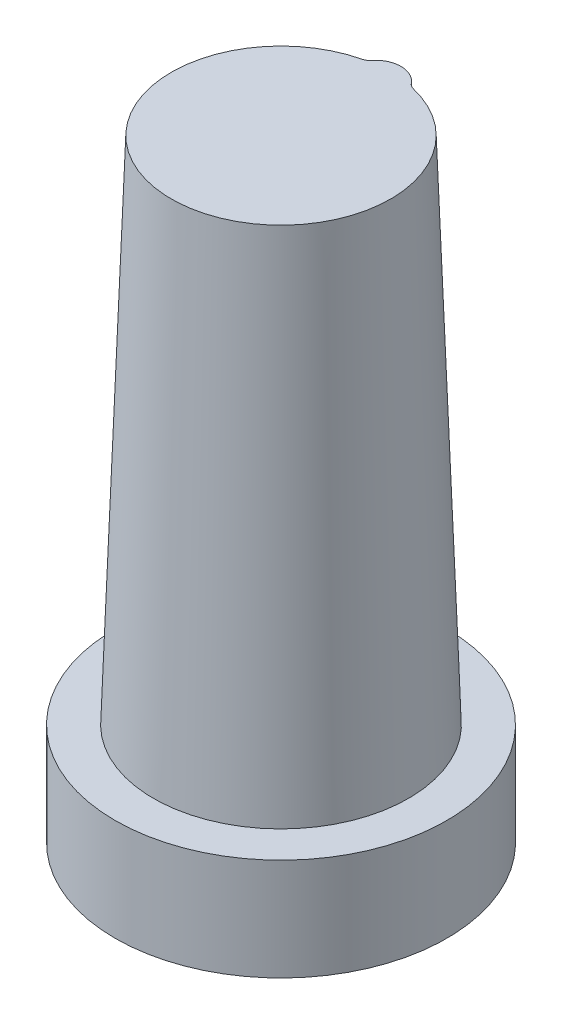
ISO-10303-21;
HEADER;
FILE_DESCRIPTION(('STEP AP214'),'2;1');
FILE_NAME('part.step','',(''),(''),'','','');
FILE_SCHEMA(('AUTOMOTIVE_DESIGN { 1 0 10303 214 1 1 1 1 }'));
ENDSEC;
DATA;
#1=APPLICATION_CONTEXT('core data for automotive mechanical design processes');
#2=APPLICATION_PROTOCOL_DEFINITION('international standard','automotive_design',2000,#1);
#3=PRODUCT_CONTEXT('',#1,'mechanical');
#4=PRODUCT('Part','Part','',(#3));
#5=PRODUCT_RELATED_PRODUCT_CATEGORY('part','',(#4));
#6=PRODUCT_DEFINITION_FORMATION('','',#4);
#7=PRODUCT_DEFINITION_CONTEXT('part definition',#1,'design');
#8=PRODUCT_DEFINITION('design','',#6,#7);
#9=PRODUCT_DEFINITION_SHAPE('','',#8);
#10=(LENGTH_UNIT() NAMED_UNIT(*) SI_UNIT(.MILLI.,.METRE.));
#11=(NAMED_UNIT(*) PLANE_ANGLE_UNIT() SI_UNIT($,.RADIAN.));
#12=(NAMED_UNIT(*) SI_UNIT($,.STERADIAN.) SOLID_ANGLE_UNIT());
#13=UNCERTAINTY_MEASURE_WITH_UNIT(LENGTH_MEASURE(1.E-05),#10,'distance_accuracy_value','');
#14=(GEOMETRIC_REPRESENTATION_CONTEXT(3) GLOBAL_UNCERTAINTY_ASSIGNED_CONTEXT((#13)) GLOBAL_UNIT_ASSIGNED_CONTEXT((#10,
#11,#12)) REPRESENTATION_CONTEXT('',''));
#15=CARTESIAN_POINT('',(0.,0.,0.));
#16=DIRECTION('',(0.,0.,1.));
#17=DIRECTION('',(1.,0.,0.));
#18=AXIS2_PLACEMENT_3D('',#15,#16,#17);
#19=CARTESIAN_POINT('',(0.,0.,0.));
#20=DIRECTION('',(0.,-1.,0.));
#21=DIRECTION('',(0.,0.,-1.));
#22=AXIS2_PLACEMENT_3D('',#19,#20,#21);
#23=CONICAL_SURFACE('',#22,25.,0.0349065850398867);
#24=CARTESIAN_POINT('',(0.,100.,0.));
#25=DIRECTION('',(0.,1.,0.));
#26=DIRECTION('',(0.,0.,1.));
#27=AXIS2_PLACEMENT_3D('',#24,#25,#26);
#28=CIRCLE('',#27,21.5079230508252);
#29=CARTESIAN_POINT('',(-5.01639940565044,100.,-20.9147433874578));
#30=VERTEX_POINT('',#29);
#31=CARTESIAN_POINT('',(5.01639940565044,100.,-20.9147433874578));
#32=VERTEX_POINT('',#31);
#33=EDGE_CURVE('E79',#30,#32,#28,.T.);
#34=ORIENTED_EDGE('',*,*,#33,.F.);
#35=CARTESIAN_POINT('',(-5.02044562321784,119.989078811724,-20.1952124893148));
#36=CARTESIAN_POINT('',(-4.35479507778671,119.995758648602,-20.3604500746817));
#37=CARTESIAN_POINT('',(-3.93073107346273,120.015722951522,-20.8991613844915));
#38=CARTESIAN_POINT('',(-5.01947061398738,115.328882871472,-20.3631438905253));
#39=CARTESIAN_POINT('',(-4.35254474239668,115.334832946307,-20.5273167248156));
#40=CARTESIAN_POINT('',(-3.92727548547261,115.355465664503,-21.066296066852));
#41=CARTESIAN_POINT('',(-5.01851832224004,110.668680836555,-20.5309447391629));
#42=CARTESIAN_POINT('',(-4.35034898234588,110.674600238674,-20.6940485121666));
#43=CARTESIAN_POINT('',(-3.92390131296418,110.69520392889,-21.2333129947227));
#44=CARTESIAN_POINT('',(-5.01386423887065,87.3679158901366,-21.3693254364855));
#45=CARTESIAN_POINT('',(-4.339621295642,87.3634761059894,-21.5275478106708));
#46=CARTESIAN_POINT('',(-3.90741484400835,87.3941481981757,-22.0678358615243));
#47=CARTESIAN_POINT('',(-5.01048439923465,68.7272674486347,-22.0380642533219));
#48=CARTESIAN_POINT('',(-4.33186294112269,68.7242424639302,-22.1923488925311));
#49=CARTESIAN_POINT('',(-3.89545511115906,68.7532918196411,-22.7336859467788));
#50=CARTESIAN_POINT('',(-5.00658860438261,45.4263606057758,-22.8721585831557));
#51=CARTESIAN_POINT('',(-4.32294221965668,45.4317232524159,-23.0216066243782));
#52=CARTESIAN_POINT('',(-3.88167616752381,45.4521476843999,-23.5643800676543));
#53=CARTESIAN_POINT('',(-5.00582589403176,40.766164186409,-23.0388863554484));
#54=CARTESIAN_POINT('',(-4.32119620322982,40.7715029701244,-23.1874436137897));
#55=CARTESIAN_POINT('',(-3.87897890920778,40.7919049379044,-23.7304383319993));
#56=CARTESIAN_POINT('',(-5.00209021478634,17.4651625679153,-23.8720937791047));
#57=CARTESIAN_POINT('',(-4.31264632818182,17.462023868725,-24.0165707359877));
#58=CARTESIAN_POINT('',(-3.86576953742503,17.4906770055999,-24.5603489119689));
#59=CARTESIAN_POINT('',(-4.99935086346516,-1.17570091920561,-24.5372791071281));
#60=CARTESIAN_POINT('',(-4.306396482311,-1.1776948659226,-24.6784527493561));
#61=CARTESIAN_POINT('',(-3.85608818351628,-1.15035050270276,-25.2230589924499));
#62=CARTESIAN_POINT('',(-4.99680464403736,-19.8166108174832,-25.2014163869768));
#63=CARTESIAN_POINT('',(-4.30059883627703,-19.8112145716458,-25.3392643130734));
#64=CARTESIAN_POINT('',(-3.84709118767394,-19.7914116862025,-25.8848578938129));
#65=(BOUNDED_SURFACE() B_SPLINE_SURFACE(3,2,((#35,#36,#37),(#38,#39,#40),(#41,#42,#43),(#44,#45,
#46),(#47,#48,#49),(#50,#51,#52),(#53,#54,#55),(#56,#57,#58),(#59,#60,#61),(#62,#63,#64)),
.UNSPECIFIED.,.F.,.F.,.F.) B_SPLINE_SURFACE_WITH_KNOTS((4,2,2,2,4),(3,3),(0.,13.9897735998265,
69.9480462444578,83.9376553769557,139.89609218411),(0.,1.),
.UNSPECIFIED.) GEOMETRIC_REPRESENTATION_ITEM() RATIONAL_B_SPLINE_SURFACE(((1.,0.945921119955479,
1.),(1.,0.945779658653169,1.),(1.,0.945641152077443,1.),(1.,0.944962646224104,1.),(1.,
0.944464702791416,1.),(1.,0.943886275003152,1.),(1.,0.94377278927941,1.),(1.,0.943215820154855,
1.),(1.,0.942803715243471,1.),(1.,0.942418155556905,1.))) REPRESENTATION_ITEM('') SURFACE());
#66=CARTESIAN_POINT('',(-5.02044562321784,119.989078811724,-20.1952124893148));
#67=CARTESIAN_POINT('',(-5.01947061398738,115.328882871472,-20.3631438905253));
#68=CARTESIAN_POINT('',(-5.01851832224004,110.668680836555,-20.5309447391629));
#69=CARTESIAN_POINT('',(-5.01386423887065,87.3679158901366,-21.3693254364855));
#70=CARTESIAN_POINT('',(-5.01048439923465,68.7272674486346,-22.0380642533219));
#71=CARTESIAN_POINT('',(-5.00658860438261,45.4263606057758,-22.8721585831557));
#72=CARTESIAN_POINT('',(-5.00582589403176,40.766164186409,-23.0388863554484));
#73=CARTESIAN_POINT('',(-5.00209021478635,17.4651625679153,-23.8720937791047));
#74=CARTESIAN_POINT('',(-4.99935086346516,-1.17570091920563,-24.5372791071281));
#75=CARTESIAN_POINT('',(-4.99680464403736,-19.8166108174832,-25.2014163869768));
#76=B_SPLINE_CURVE_WITH_KNOTS('',3,(#66,#67,#68,#69,#70,#71,#72,#73,#74,#75),.UNSPECIFIED.,.F.,
.F.,(4,2,2,2,4),(0.,13.9897735998265,69.9480462444578,83.9376553769557,139.89609218411),.UNSPECIFIED.);
#77=CARTESIAN_POINT('',(-4.99958653974889,0.,-24.4949818214173));
#78=VERTEX_POINT('',#77);
#79=EDGE_CURVE('E88',#30,#78,#76,.T.);
#80=ORIENTED_EDGE('',*,*,#79,.T.);
#81=CARTESIAN_POINT('',(0.,0.,0.));
#82=DIRECTION('',(0.,-1.,0.));
#83=DIRECTION('',(0.,0.,-1.));
#84=AXIS2_PLACEMENT_3D('',#81,#82,#83);
#85=CIRCLE('',#84,25.);
#86=CARTESIAN_POINT('',(4.99958653974889,0.,-24.4949818214173));
#87=VERTEX_POINT('',#86);
#88=EDGE_CURVE('E93',#87,#78,#85,.T.);
#89=ORIENTED_EDGE('',*,*,#88,.F.);
#90=CARTESIAN_POINT('',(4.99677938212991,-20.0016701134443,-25.2080095784263));
#91=CARTESIAN_POINT('',(4.30054128360439,-19.9962752352904,-25.345827153621));
#92=CARTESIAN_POINT('',(3.84700191277261,-19.9764724823672,-25.8914278946976));
#93=CARTESIAN_POINT('',(4.99741551651807,-15.3414846392876,-25.041978947738));
#94=CARTESIAN_POINT('',(4.30199016700524,-15.3365171318982,-25.1805771632177));
#95=CARTESIAN_POINT('',(3.84924969557247,-15.3162492140467,-25.7259815595286));
#96=CARTESIAN_POINT('',(4.99806372146368,-10.6813020417971,-24.8758828834013));
#97=CARTESIAN_POINT('',(4.30346733239025,-10.6763213782028,-25.0152585404817));
#98=CARTESIAN_POINT('',(3.8515402348203,-10.6560280275222,-25.5604783615997));
#99=CARTESIAN_POINT('',(5.00136953009968,12.6198048870463,-24.0450416691774));
#100=CARTESIAN_POINT('',(4.31100238651037,12.6175231032378,-24.1886300894718));
#101=CARTESIAN_POINT('',(3.86322268982986,12.6452761621235,-24.7326463157513));
#102=CARTESIAN_POINT('',(5.00422140096267,31.260682233974,-23.3792362374521));
#103=CARTESIAN_POINT('',(4.31751635490357,31.2573241832303,-23.5262373789623));
#104=CARTESIAN_POINT('',(3.87330358316499,31.286325122703,-24.069391617021));
#105=CARTESIAN_POINT('',(5.00811568480839,54.5616853293637,-22.5451460934502));
#106=CARTESIAN_POINT('',(4.32644028666031,54.5671280761289,-22.6963700789024));
#107=CARTESIAN_POINT('',(3.88707728065921,54.5875654231534,-23.2387004070793));
#108=CARTESIAN_POINT('',(5.00891101245084,59.221873395932,-22.3782366791741));
#109=CARTESIAN_POINT('',(4.32826323556492,59.227333159945,-22.5303832889371));
#110=CARTESIAN_POINT('',(3.88989064428123,59.2478020650484,-23.0724813043102));
#111=CARTESIAN_POINT('',(5.01297608511572,82.5227912909358,-21.5431935605643));
#112=CARTESIAN_POINT('',(4.33758374399139,82.5195768577721,-21.7003497439712));
#113=CARTESIAN_POINT('',(3.90427273246388,82.5489690029482,-22.2409446328535));
#114=CARTESIAN_POINT('',(5.01651113340562,101.163453255776,-20.8735717342237));
#115=CARTESIAN_POINT('',(4.3457112125468,101.158991553546,-21.0348042536603));
#116=CARTESIAN_POINT('',(3.91678726692253,101.18984993414,-21.5743036109342));
#117=CARTESIAN_POINT('',(5.02040690671447,119.804019170757,-20.2018811672384));
#118=CARTESIAN_POINT('',(4.35470573434587,119.81069689654,-20.3670755144069));
#119=CARTESIAN_POINT('',(3.93059385916635,119.830660874043,-20.9057984229462));
#120=(BOUNDED_SURFACE() B_SPLINE_SURFACE(3,2,((#90,#91,#92),(#93,#94,#95),(#96,#97,#98),(#99,
#100,#101),(#102,#103,#104),(#105,#106,#107),(#108,#109,#110),(#111,#112,#113),(#114,#115,#116),
(#117,#118,#119)),.UNSPECIFIED.,.F.,.F.,.F.) B_SPLINE_SURFACE_WITH_KNOTS((4,2,2,2,4),(3,3),(0.,
13.9894829659148,69.9480440393491,83.937652794903,139.896088367554),(0.,1.),
.UNSPECIFIED.) GEOMETRIC_REPRESENTATION_ITEM() RATIONAL_B_SPLINE_SURFACE(((1.,0.94241432817959,
1.),(1.,0.94251066239949,1.),(1.,0.942608655679638,1.),(1.,0.943107465110346,1.),(1.,
0.943534797525917,1.),(1.,0.944113009912961,1.),(1.,0.944230854528456,1.),(1.,0.944831822378394,
1.),(1.,0.945350179916769,1.),(1.,0.945915503565024,1.))) REPRESENTATION_ITEM('') SURFACE());
#121=CARTESIAN_POINT('',(4.99677938212991,-20.0016701134443,-25.2080095784263));
#122=CARTESIAN_POINT('',(4.99741551651807,-15.3414846392876,-25.041978947738));
#123=CARTESIAN_POINT('',(4.99806372146368,-10.6813020417971,-24.8758828834013));
#124=CARTESIAN_POINT('',(5.00136953009968,12.6198048870463,-24.0450416691774));
#125=CARTESIAN_POINT('',(5.00422140096267,31.260682233974,-23.3792362374521));
#126=CARTESIAN_POINT('',(5.00811568480839,54.5616853293637,-22.5451460934502));
#127=CARTESIAN_POINT('',(5.00891101245084,59.221873395932,-22.3782366791741));
#128=CARTESIAN_POINT('',(5.01297608511572,82.5227912909358,-21.5431935605643));
#129=CARTESIAN_POINT('',(5.01651113340562,101.163453255776,-20.8735717342237));
#130=CARTESIAN_POINT('',(5.02040690671447,119.804019170757,-20.2018811672384));
#131=B_SPLINE_CURVE_WITH_KNOTS('',3,(#121,#122,#123,#124,#125,#126,#127,#128,#129,#130),
.UNSPECIFIED.,.F.,.F.,(4,2,2,2,4),(0.,13.9894829659148,69.9480440393491,83.937652794903,
139.896088367554),.UNSPECIFIED.);
#132=EDGE_CURVE('E91',#87,#32,#131,.T.);
#133=ORIENTED_EDGE('',*,*,#132,.T.);
#134=EDGE_LOOP('',(#34,#80,#89,#133));
#135=FACE_BOUND('',#134,.T.);
#136=ADVANCED_FACE('F33',(#135),#23,.T.);
#137=CARTESIAN_POINT('',(0.,100.,0.));
#138=DIRECTION('',(0.,1.,0.));
#139=DIRECTION('',(0.,0.,1.));
#140=AXIS2_PLACEMENT_3D('',#137,#138,#139);
#141=PLANE('',#140);
#142=CARTESIAN_POINT('',(0.,100.,-18.5079230508252));
#143=DIRECTION('',(0.,1.,0.));
#144=DIRECTION('',(0.,0.,1.));
#145=AXIS2_PLACEMENT_3D('',#142,#143,#144);
#146=CIRCLE('',#145,5.00000000000001);
#147=CARTESIAN_POINT('',(3.9163775375117,100.,-21.6162967387324));
#148=VERTEX_POINT('',#147);
#149=CARTESIAN_POINT('',(-3.9163775375117,100.,-21.6162967387324));
#150=VERTEX_POINT('',#149);
#151=EDGE_CURVE('E80',#148,#150,#146,.T.);
#152=ORIENTED_EDGE('',*,*,#151,.T.);
#153=CARTESIAN_POINT('',(-3.9163775375117,100.,-21.6162967387324));
#154=CARTESIAN_POINT('',(-3.95183093790759,100.,-21.5716266778469));
#155=CARTESIAN_POINT('',(-3.98918015506861,100.,-21.5284935782017));
#156=CARTESIAN_POINT('',(-4.06741909878474,100.,-21.445571895414));
#157=CARTESIAN_POINT('',(-4.10830864973335,100.,-21.4057831465788));
#158=CARTESIAN_POINT('',(-4.23352902277785,100.,-21.2939649933365));
#159=CARTESIAN_POINT('',(-4.32243476664647,100.,-21.2269518642114));
#160=CARTESIAN_POINT('',(-4.50729170648368,100.,-21.1103820693175));
#161=CARTESIAN_POINT('',(-4.60295074361009,100.,-21.0603611754672));
#162=CARTESIAN_POINT('',(-4.75279673820841,100.,-20.9967874393374));
#163=CARTESIAN_POINT('',(-4.80454363140539,100.,-20.977326145246));
#164=CARTESIAN_POINT('',(-4.90947457746629,100.,-20.9427487713356));
#165=CARTESIAN_POINT('',(-4.96265876056681,100.,-20.9276330867378));
#166=CARTESIAN_POINT('',(-5.01639940565044,100.,-20.9147433874578));
#167=B_SPLINE_CURVE_WITH_KNOTS('',3,(#153,#154,#155,#156,#157,#158,#159,#160,#161,#162,#163,
#164,#165,#166),.UNSPECIFIED.,.F.,.F.,(4,2,2,2,2,2,4),(0.,0.170986020006759,0.341963563673231,
0.674321049150451,0.996686876111775,1.1623753196076,1.32807882724402),.UNSPECIFIED.);
#168=EDGE_CURVE('E46',#150,#30,#167,.T.);
#169=ORIENTED_EDGE('',*,*,#168,.T.);
#170=ORIENTED_EDGE('',*,*,#33,.T.);
#171=CARTESIAN_POINT('',(5.01639940565044,100.,-20.9147433874578));
#172=CARTESIAN_POINT('',(4.96095493701557,100.,-20.928036889942));
#173=CARTESIAN_POINT('',(4.90610502966318,100.,-20.943701090674));
#174=CARTESIAN_POINT('',(4.79794644081407,100.,-20.979654321375));
#175=CARTESIAN_POINT('',(4.74463766027271,100.,-20.9999430533882));
#176=CARTESIAN_POINT('',(4.59047868428006,100.,-21.0663093358371));
#177=CARTESIAN_POINT('',(4.4922489468029,100.,-21.1186528829342));
#178=CARTESIAN_POINT('',(4.30859086135556,100.,-21.2371038354565));
#179=CARTESIAN_POINT('',(4.22286979086053,100.,-21.302758291809));
#180=CARTESIAN_POINT('',(4.10199722036175,100.,-21.4118397304487));
#181=CARTESIAN_POINT('',(4.06251657758827,100.,-21.4505610632518));
#182=CARTESIAN_POINT('',(3.98688860761049,100.,-21.5311393984708));
#183=CARTESIAN_POINT('',(3.95074159258597,100.,-21.5729966938922));
#184=CARTESIAN_POINT('',(3.9163775375117,100.,-21.6162967387324));
#185=B_SPLINE_CURVE_WITH_KNOTS('',3,(#171,#172,#173,#174,#175,#176,#177,#178,#179,#180,#181,
#182,#183,#184),.UNSPECIFIED.,.F.,.F.,(4,2,2,2,2,2,4),(0.,0.170944905502815,0.34187880023952,
0.674155557001438,0.996603276127007,1.16233456632935,1.32808136082202),.UNSPECIFIED.);
#186=EDGE_CURVE('E11',#32,#148,#185,.T.);
#187=ORIENTED_EDGE('',*,*,#186,.T.);
#188=EDGE_LOOP('',(#152,#169,#170,#187));
#189=FACE_BOUND('',#188,.T.);
#190=ADVANCED_FACE('F78',(#189),#141,.T.);
#191=CARTESIAN_POINT('',(0.,0.,0.));
#192=DIRECTION('',(0.,-1.,0.));
#193=DIRECTION('',(0.,0.,-1.));
#194=AXIS2_PLACEMENT_3D('',#191,#192,#193);
#195=PLANE('',#194);
#196=CARTESIAN_POINT('',(0.,0.,0.));
#197=DIRECTION('',(0.,-1.,0.));
#198=DIRECTION('',(0.,0.,-1.));
#199=AXIS2_PLACEMENT_3D('',#196,#197,#198);
#200=CIRCLE('',#199,32.5);
#201=CARTESIAN_POINT('',(0.,0.,-32.5));
#202=VERTEX_POINT('',#201);
#203=EDGE_CURVE('E182',#202,#202,#200,.T.);
#204=ORIENTED_EDGE('',*,*,#203,.F.);
#205=EDGE_LOOP('',(#204));
#206=FACE_BOUND('',#205,.T.);
#207=ORIENTED_EDGE('',*,*,#88,.T.);
#208=CARTESIAN_POINT('',(-4.99958653974889,0.,-24.4949818214173));
#209=CARTESIAN_POINT('',(-4.94450104905821,0.,-24.5062233956565));
#210=CARTESIAN_POINT('',(-4.88991295431892,0.,-24.5197880106889));
#211=CARTESIAN_POINT('',(-4.78207789306795,0.,-24.5514617566637));
#212=CARTESIAN_POINT('',(-4.72883078315274,0.,-24.5695703993823));
#213=CARTESIAN_POINT('',(-4.57456273374289,0.,-24.6294161364588));
#214=CARTESIAN_POINT('',(-4.47586843496068,0.,-24.6773262846231));
#215=CARTESIAN_POINT('',(-4.28359778447704,0.,-24.7910300570183));
#216=CARTESIAN_POINT('',(-4.1904206391278,0.,-24.8575006859255));
#217=CARTESIAN_POINT('',(-4.05894051106943,0.,-24.969370316124));
#218=CARTESIAN_POINT('',(-4.01593430243299,0.,-25.0093618796891));
#219=CARTESIAN_POINT('',(-3.93359593261265,0.,-25.0929676434467));
#220=CARTESIAN_POINT('',(-3.89426395901405,0.,-25.1365820283852));
#221=CARTESIAN_POINT('',(-3.85690892904548,0.,-25.1818632140696));
#222=B_SPLINE_CURVE_WITH_KNOTS('',3,(#208,#209,#210,#211,#212,#213,#214,#215,#216,#217,#218,
#219,#220,#221),.UNSPECIFIED.,.F.,.F.,(4,2,2,2,2,2,4),(0.,0.168567281049587,0.337116458478242,
0.664695252527266,1.0062791060069,1.18226073118182,1.35825133606191),.UNSPECIFIED.);
#223=CARTESIAN_POINT('',(-3.85690892904548,0.,-25.1818632140696));
#224=VERTEX_POINT('',#223);
#225=EDGE_CURVE('E96',#78,#224,#222,.T.);
#226=ORIENTED_EDGE('',*,*,#225,.T.);
#227=CARTESIAN_POINT('',(0.,0.,-22.));
#228=DIRECTION('',(0.,1.,0.));
#229=DIRECTION('',(0.,0.,1.));
#230=AXIS2_PLACEMENT_3D('',#227,#228,#229);
#231=CIRCLE('',#230,5.00000000000001);
#232=CARTESIAN_POINT('',(3.85690892904548,0.,-25.1818632140696));
#233=VERTEX_POINT('',#232);
#234=EDGE_CURVE('E92',#224,#233,#231,.F.);
#235=ORIENTED_EDGE('',*,*,#234,.T.);
#236=CARTESIAN_POINT('',(3.85690892904548,0.,-25.1818632140696));
#237=CARTESIAN_POINT('',(3.8934300231,0.,-25.1375925942019));
#238=CARTESIAN_POINT('',(3.93184214556877,0.,-25.0949144323508));
#239=CARTESIAN_POINT('',(4.01218449867153,0.,-25.0130156079772));
#240=CARTESIAN_POINT('',(4.05411445762223,0.,-24.9737946789309));
#241=CARTESIAN_POINT('',(4.18228244366265,0.,-24.8638708183924));
#242=CARTESIAN_POINT('',(4.27303976877552,0.,-24.7983294651315));
#243=CARTESIAN_POINT('',(4.46443947486402,0.,-24.6831621660983));
#244=CARTESIAN_POINT('',(4.56510462511108,0.,-24.6335740531235));
#245=CARTESIAN_POINT('',(4.7226576428558,0.,-24.5717405808073));
#246=CARTESIAN_POINT('',(4.77709205229301,0.,-24.5530496443913));
#247=CARTESIAN_POINT('',(4.88737236759274,0.,-24.5204224210702));
#248=CARTESIAN_POINT('',(4.94321838547122,0.,-24.5064865127731));
#249=CARTESIAN_POINT('',(4.99958653974889,0.,-24.4949818214173));
#250=B_SPLINE_CURVE_WITH_KNOTS('',3,(#236,#237,#238,#239,#240,#241,#242,#243,#244,#245,#246,
#247,#248,#249),.UNSPECIFIED.,.F.,.F.,(4,2,2,2,2,2,4),(0.,0.17206896939646,0.344124662079863,
0.678315154199079,1.01329242843622,1.18576543647272,1.35825217406904),.UNSPECIFIED.);
#251=EDGE_CURVE('E97',#233,#87,#250,.T.);
#252=ORIENTED_EDGE('',*,*,#251,.T.);
#253=EDGE_LOOP('',(#207,#226,#235,#252));
#254=FACE_BOUND('',#253,.T.);
#255=ADVANCED_FACE('F159',(#206,#254),#195,.F.);
#256=CARTESIAN_POINT('',(0.,-20.,0.));
#257=DIRECTION('',(0.,1.,0.));
#258=DIRECTION('',(0.,0.,1.));
#259=AXIS2_PLACEMENT_3D('',#256,#257,#258);
#260=CYLINDRICAL_SURFACE('',#259,32.5);
#261=CARTESIAN_POINT('',(0.,-20.,0.));
#262=DIRECTION('',(0.,-1.,0.));
#263=DIRECTION('',(0.,0.,-1.));
#264=AXIS2_PLACEMENT_3D('',#261,#262,#263);
#265=CIRCLE('',#264,32.5);
#266=CARTESIAN_POINT('',(0.,-20.,-32.5));
#267=VERTEX_POINT('',#266);
#268=EDGE_CURVE('E193',#267,#267,#265,.T.);
#269=ORIENTED_EDGE('',*,*,#268,.F.);
#270=EDGE_LOOP('',(#269));
#271=FACE_BOUND('',#270,.T.);
#272=ORIENTED_EDGE('',*,*,#203,.T.);
#273=EDGE_LOOP('',(#272));
#274=FACE_BOUND('',#273,.T.);
#275=ADVANCED_FACE('F163',(#271,#274),#260,.T.);
#276=CARTESIAN_POINT('',(0.,-20.,0.));
#277=DIRECTION('',(0.,-1.,0.));
#278=DIRECTION('',(0.,0.,-1.));
#279=AXIS2_PLACEMENT_3D('',#276,#277,#278);
#280=PLANE('',#279);
#281=ORIENTED_EDGE('',*,*,#268,.T.);
#282=EDGE_LOOP('',(#281));
#283=FACE_BOUND('',#282,.T.);
#284=ADVANCED_FACE('F200',(#283),#280,.T.);
#285=CARTESIAN_POINT('',(0.,0.,-22.));
#286=DIRECTION('',(0.,1.,0.));
#287=DIRECTION('',(0.,0.,1.));
#288=AXIS2_PLACEMENT_3D('',#285,#286,#287);
#289=CIRCLE('',#288,5.00000000000001);
#290=DIRECTION('',(0.,0.999390827019096,0.034899496702501));
#291=VECTOR('',#290,1.);
#292=SURFACE_OF_LINEAR_EXTRUSION('',#289,#291);
#293=ORIENTED_EDGE('',*,*,#234,.F.);
#294=CARTESIAN_POINT('',(-3.84709118767394,-19.7914116862025,-25.8848578938129));
#295=CARTESIAN_POINT('',(-3.85608818351628,-1.15035050270277,-25.2230589924499));
#296=CARTESIAN_POINT('',(-3.86576953742503,17.4906770055999,-24.5603489119689));
#297=CARTESIAN_POINT('',(-3.87897890920778,40.7919049379044,-23.7304383319993));
#298=CARTESIAN_POINT('',(-3.88167616752381,45.4521476843999,-23.5643800676543));
#299=CARTESIAN_POINT('',(-3.89545511115906,68.7532918196411,-22.7336859467788));
#300=CARTESIAN_POINT('',(-3.90741484400835,87.3941481981757,-22.0678358615243));
#301=CARTESIAN_POINT('',(-3.92390131296418,110.69520392889,-21.2333129947227));
#302=CARTESIAN_POINT('',(-3.92727548547261,115.355465664503,-21.066296066852));
#303=CARTESIAN_POINT('',(-3.93073107346273,120.015722951522,-20.8991613844915));
#304=B_SPLINE_CURVE_WITH_KNOTS('',3,(#294,#295,#296,#297,#298,#299,#300,#301,#302,#303),
.UNSPECIFIED.,.F.,.F.,(4,2,2,2,4),(0.,55.9584368071545,69.9480459396524,125.906318584284,
139.89609218411),.UNSPECIFIED.);
#305=EDGE_CURVE('E54',#224,#150,#304,.T.);
#306=ORIENTED_EDGE('',*,*,#305,.T.);
#307=ORIENTED_EDGE('',*,*,#151,.F.);
#308=CARTESIAN_POINT('',(3.93059385916635,119.830660874043,-20.9057984229462));
#309=CARTESIAN_POINT('',(3.91678726692253,101.18984993414,-21.5743036109342));
#310=CARTESIAN_POINT('',(3.90427273246388,82.5489690029482,-22.2409446328535));
#311=CARTESIAN_POINT('',(3.88989064428123,59.2478020650484,-23.0724813043102));
#312=CARTESIAN_POINT('',(3.88707728065921,54.5875654231534,-23.2387004070793));
#313=CARTESIAN_POINT('',(3.87330358316499,31.286325122703,-24.069391617021));
#314=CARTESIAN_POINT('',(3.86322268982986,12.6452761621235,-24.7326463157513));
#315=CARTESIAN_POINT('',(3.8515402348203,-10.6560280275222,-25.5604783615997));
#316=CARTESIAN_POINT('',(3.84924969557247,-15.3162492140467,-25.7259815595286));
#317=CARTESIAN_POINT('',(3.84700191277261,-19.9764724823672,-25.8914278946976));
#318=B_SPLINE_CURVE_WITH_KNOTS('',3,(#308,#309,#310,#311,#312,#313,#314,#315,#316,#317),
.UNSPECIFIED.,.F.,.F.,(4,2,2,2,4),(0.,55.958435572651,69.9480443282049,125.906605401639,
139.896088367554),.UNSPECIFIED.);
#319=EDGE_CURVE('E176',#148,#233,#318,.T.);
#320=ORIENTED_EDGE('',*,*,#319,.T.);
#321=EDGE_LOOP('',(#293,#306,#307,#320));
#322=FACE_BOUND('',#321,.T.);
#323=ADVANCED_FACE('F128',(#322),#292,.T.);
#324=ORIENTED_EDGE('',*,*,#168,.F.);
#325=ORIENTED_EDGE('',*,*,#305,.F.);
#326=ORIENTED_EDGE('',*,*,#225,.F.);
#327=ORIENTED_EDGE('',*,*,#79,.F.);
#328=EDGE_LOOP('',(#324,#325,#326,#327));
#329=FACE_BOUND('',#328,.T.);
#330=ADVANCED_FACE('F95',(#329),#65,.F.);
#331=ORIENTED_EDGE('',*,*,#251,.F.);
#332=ORIENTED_EDGE('',*,*,#319,.F.);
#333=ORIENTED_EDGE('',*,*,#186,.F.);
#334=ORIENTED_EDGE('',*,*,#132,.F.);
#335=EDGE_LOOP('',(#331,#332,#333,#334));
#336=FACE_BOUND('',#335,.T.);
#337=ADVANCED_FACE('F127',(#336),#120,.F.);
#338=CLOSED_SHELL('',(#136,#190,#255,#275,#284,#323,#330,#337));
#339=MANIFOLD_SOLID_BREP('B2',#338);
#340=ADVANCED_BREP_SHAPE_REPRESENTATION('',(#18,#339),#14);
#341=SHAPE_DEFINITION_REPRESENTATION(#9,#340);
ENDSEC;
END-ISO-10303-21;
